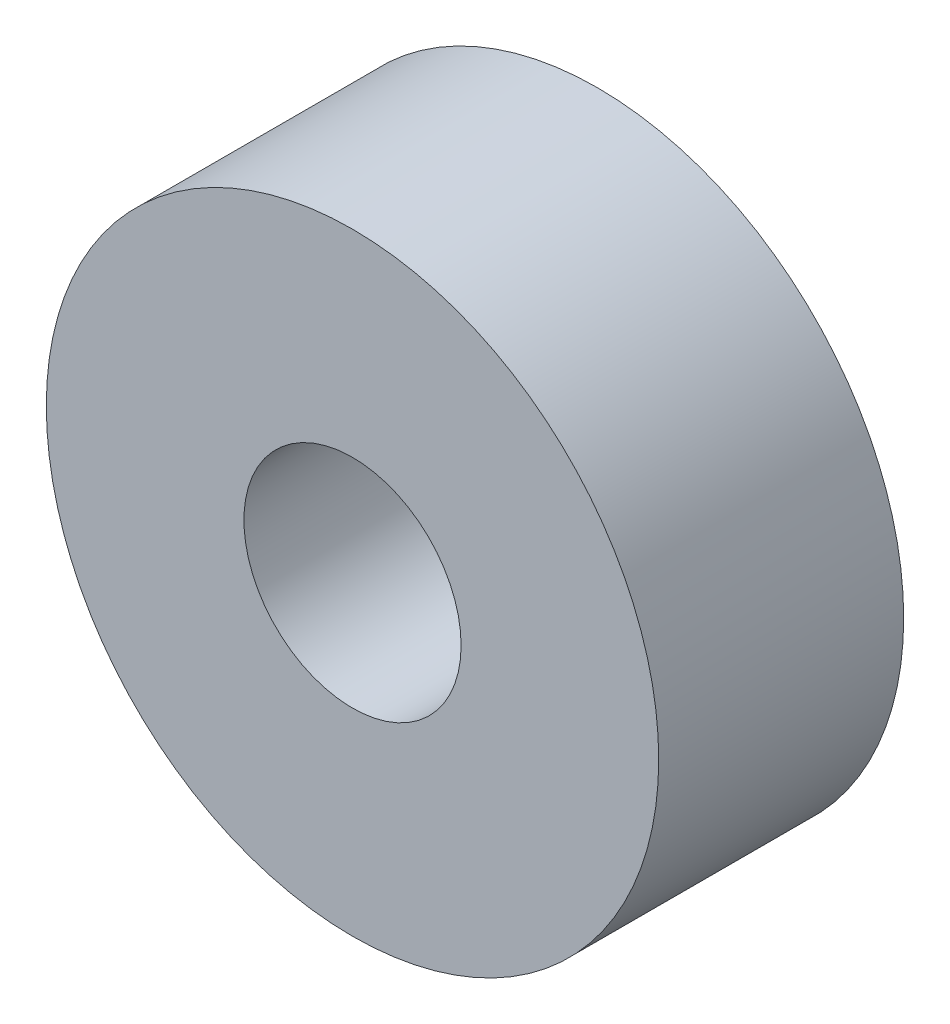
ISO-10303-21;
HEADER;
FILE_DESCRIPTION(('STEP AP214'),'2;1');
FILE_NAME('part.step','',(''),(''),'','','');
FILE_SCHEMA(('AUTOMOTIVE_DESIGN { 1 0 10303 214 1 1 1 1 }'));
ENDSEC;
DATA;
#1=APPLICATION_CONTEXT('core data for automotive mechanical design processes');
#2=APPLICATION_PROTOCOL_DEFINITION('international standard','automotive_design',2000,#1);
#3=PRODUCT_CONTEXT('',#1,'mechanical');
#4=PRODUCT('Part','Part','',(#3));
#5=PRODUCT_RELATED_PRODUCT_CATEGORY('part','',(#4));
#6=PRODUCT_DEFINITION_FORMATION('','',#4);
#7=PRODUCT_DEFINITION_CONTEXT('part definition',#1,'design');
#8=PRODUCT_DEFINITION('design','',#6,#7);
#9=PRODUCT_DEFINITION_SHAPE('','',#8);
#10=(LENGTH_UNIT() NAMED_UNIT(*) SI_UNIT(.MILLI.,.METRE.));
#11=(NAMED_UNIT(*) PLANE_ANGLE_UNIT() SI_UNIT($,.RADIAN.));
#12=(NAMED_UNIT(*) SI_UNIT($,.STERADIAN.) SOLID_ANGLE_UNIT());
#13=UNCERTAINTY_MEASURE_WITH_UNIT(LENGTH_MEASURE(1.E-05),#10,'distance_accuracy_value','');
#14=(GEOMETRIC_REPRESENTATION_CONTEXT(3) GLOBAL_UNCERTAINTY_ASSIGNED_CONTEXT((#13)) GLOBAL_UNIT_ASSIGNED_CONTEXT((#10,
#11,#12)) REPRESENTATION_CONTEXT('',''));
#15=CARTESIAN_POINT('',(0.,0.,0.));
#16=DIRECTION('',(0.,0.,1.));
#17=DIRECTION('',(1.,0.,0.));
#18=AXIS2_PLACEMENT_3D('',#15,#16,#17);
#19=CARTESIAN_POINT('',(0.,0.,3.81));
#20=DIRECTION('',(0.,0.,-1.));
#21=DIRECTION('',(-1.,0.,0.));
#22=AXIS2_PLACEMENT_3D('',#19,#20,#21);
#23=CYLINDRICAL_SURFACE('',#22,9.525);
#24=CARTESIAN_POINT('',(0.,0.,3.81));
#25=DIRECTION('',(0.,0.,1.));
#26=DIRECTION('',(1.,0.,0.));
#27=AXIS2_PLACEMENT_3D('',#24,#25,#26);
#28=CIRCLE('',#27,9.525);
#29=CARTESIAN_POINT('',(9.525,0.,3.81));
#30=VERTEX_POINT('',#29);
#31=EDGE_CURVE('E10',#30,#30,#28,.T.);
#32=ORIENTED_EDGE('',*,*,#31,.F.);
#33=EDGE_LOOP('',(#32));
#34=FACE_BOUND('',#33,.T.);
#35=CARTESIAN_POINT('',(0.,0.,-3.81));
#36=DIRECTION('',(0.,0.,1.));
#37=DIRECTION('',(1.,0.,0.));
#38=AXIS2_PLACEMENT_3D('',#35,#36,#37);
#39=CIRCLE('',#38,9.525);
#40=CARTESIAN_POINT('',(9.525,0.,-3.81));
#41=VERTEX_POINT('',#40);
#42=EDGE_CURVE('E35',#41,#41,#39,.T.);
#43=ORIENTED_EDGE('',*,*,#42,.T.);
#44=EDGE_LOOP('',(#43));
#45=FACE_BOUND('',#44,.T.);
#46=ADVANCED_FACE('F32',(#34,#45),#23,.T.);
#47=CARTESIAN_POINT('',(0.,0.,3.81));
#48=DIRECTION('',(0.,0.,1.));
#49=DIRECTION('',(1.,0.,0.));
#50=AXIS2_PLACEMENT_3D('',#47,#48,#49);
#51=PLANE('',#50);
#52=CARTESIAN_POINT('',(0.,0.,3.81));
#53=DIRECTION('',(0.,0.,1.));
#54=DIRECTION('',(1.,0.,0.));
#55=AXIS2_PLACEMENT_3D('',#52,#53,#54);
#56=CIRCLE('',#55,3.3782);
#57=CARTESIAN_POINT('',(3.3782,0.,3.81));
#58=VERTEX_POINT('',#57);
#59=EDGE_CURVE('E46',#58,#58,#56,.T.);
#60=ORIENTED_EDGE('',*,*,#59,.F.);
#61=EDGE_LOOP('',(#60));
#62=FACE_BOUND('',#61,.T.);
#63=ORIENTED_EDGE('',*,*,#31,.T.);
#64=EDGE_LOOP('',(#63));
#65=FACE_BOUND('',#64,.T.);
#66=ADVANCED_FACE('F53',(#62,#65),#51,.T.);
#67=CARTESIAN_POINT('',(0.,0.,-3.81));
#68=DIRECTION('',(0.,0.,1.));
#69=DIRECTION('',(1.,0.,0.));
#70=AXIS2_PLACEMENT_3D('',#67,#68,#69);
#71=PLANE('',#70);
#72=CARTESIAN_POINT('',(0.,0.,-3.81));
#73=DIRECTION('',(0.,0.,1.));
#74=DIRECTION('',(1.,0.,0.));
#75=AXIS2_PLACEMENT_3D('',#72,#73,#74);
#76=CIRCLE('',#75,3.3782);
#77=CARTESIAN_POINT('',(3.3782,0.,-3.81));
#78=VERTEX_POINT('',#77);
#79=EDGE_CURVE('E42',#78,#78,#76,.F.);
#80=ORIENTED_EDGE('',*,*,#79,.F.);
#81=EDGE_LOOP('',(#80));
#82=FACE_BOUND('',#81,.T.);
#83=ORIENTED_EDGE('',*,*,#42,.F.);
#84=EDGE_LOOP('',(#83));
#85=FACE_BOUND('',#84,.T.);
#86=ADVANCED_FACE('F55',(#82,#85),#71,.F.);
#87=CARTESIAN_POINT('',(0.,0.,-3.811));
#88=DIRECTION('',(0.,0.,1.));
#89=DIRECTION('',(1.,0.,0.));
#90=AXIS2_PLACEMENT_3D('',#87,#88,#89);
#91=CYLINDRICAL_SURFACE('',#90,3.3782);
#92=ORIENTED_EDGE('',*,*,#59,.T.);
#93=EDGE_LOOP('',(#92));
#94=FACE_BOUND('',#93,.T.);
#95=ORIENTED_EDGE('',*,*,#79,.T.);
#96=EDGE_LOOP('',(#95));
#97=FACE_BOUND('',#96,.T.);
#98=ADVANCED_FACE('F50',(#94,#97),#91,.F.);
#99=CLOSED_SHELL('',(#46,#66,#86,#98));
#100=MANIFOLD_SOLID_BREP('B2',#99);
#101=ADVANCED_BREP_SHAPE_REPRESENTATION('',(#18,#100),#14);
#102=SHAPE_DEFINITION_REPRESENTATION(#9,#101);
ENDSEC;
END-ISO-10303-21;
